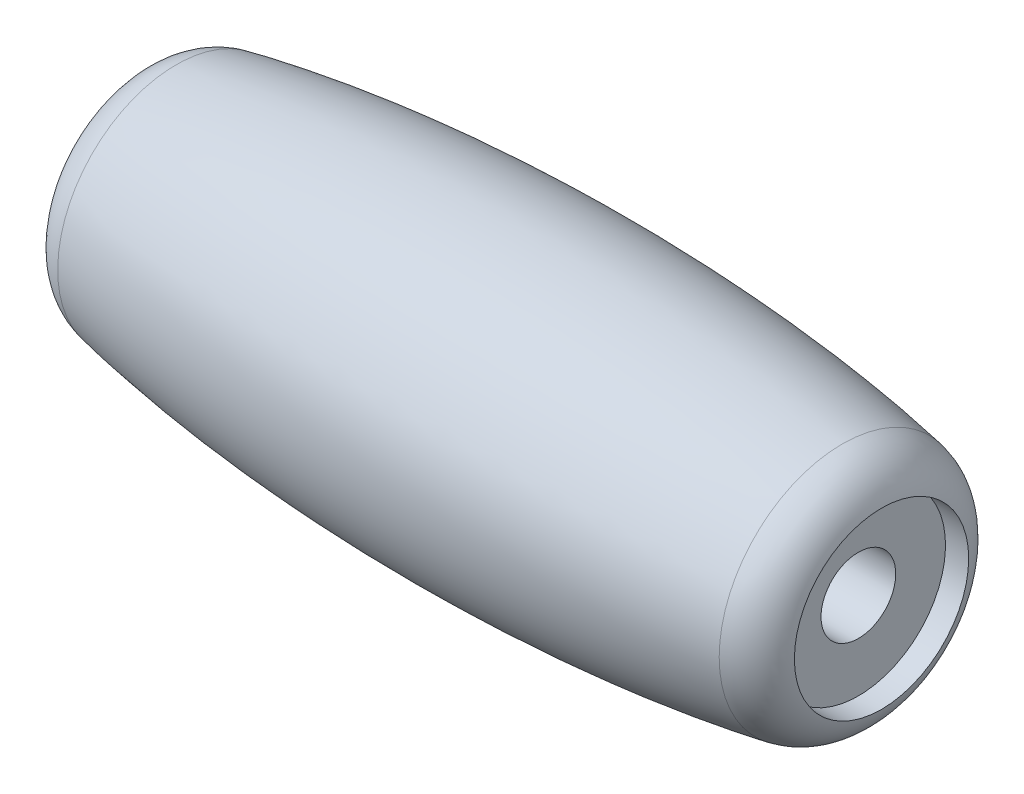
ISO-10303-21;
HEADER;
FILE_DESCRIPTION(('STEP AP214'),'2;1');
FILE_NAME('part.step','',(''),(''),'','','');
FILE_SCHEMA(('AUTOMOTIVE_DESIGN { 1 0 10303 214 1 1 1 1 }'));
ENDSEC;
DATA;
#1=APPLICATION_CONTEXT('core data for automotive mechanical design processes');
#2=APPLICATION_PROTOCOL_DEFINITION('international standard','automotive_design',2000,#1);
#3=PRODUCT_CONTEXT('',#1,'mechanical');
#4=PRODUCT('Part','Part','',(#3));
#5=PRODUCT_RELATED_PRODUCT_CATEGORY('part','',(#4));
#6=PRODUCT_DEFINITION_FORMATION('','',#4);
#7=PRODUCT_DEFINITION_CONTEXT('part definition',#1,'design');
#8=PRODUCT_DEFINITION('design','',#6,#7);
#9=PRODUCT_DEFINITION_SHAPE('','',#8);
#10=(LENGTH_UNIT() NAMED_UNIT(*) SI_UNIT(.MILLI.,.METRE.));
#11=(NAMED_UNIT(*) PLANE_ANGLE_UNIT() SI_UNIT($,.RADIAN.));
#12=(NAMED_UNIT(*) SI_UNIT($,.STERADIAN.) SOLID_ANGLE_UNIT());
#13=UNCERTAINTY_MEASURE_WITH_UNIT(LENGTH_MEASURE(1.E-05),#10,'distance_accuracy_value','');
#14=(GEOMETRIC_REPRESENTATION_CONTEXT(3) GLOBAL_UNCERTAINTY_ASSIGNED_CONTEXT((#13)) GLOBAL_UNIT_ASSIGNED_CONTEXT((#10,
#11,#12)) REPRESENTATION_CONTEXT('',''));
#15=CARTESIAN_POINT('',(0.,0.,0.));
#16=DIRECTION('',(0.,0.,1.));
#17=DIRECTION('',(1.,0.,0.));
#18=AXIS2_PLACEMENT_3D('',#15,#16,#17);
#19=CARTESIAN_POINT('',(-15.4738700674317,0.,0.));
#20=DIRECTION('',(1.,0.,0.));
#21=DIRECTION('',(0.,1.,0.));
#22=AXIS2_PLACEMENT_3D('',#19,#20,#21);
#23=CYLINDRICAL_SURFACE('',#22,1.5);
#24=CARTESIAN_POINT('',(13.5261299325683,0.,0.));
#25=DIRECTION('',(1.,0.,0.));
#26=DIRECTION('',(0.,1.,0.));
#27=AXIS2_PLACEMENT_3D('',#24,#25,#26);
#28=CIRCLE('',#27,1.5);
#29=CARTESIAN_POINT('',(13.5261299325683,1.5,0.));
#30=VERTEX_POINT('',#29);
#31=EDGE_CURVE('E55',#30,#30,#28,.T.);
#32=ORIENTED_EDGE('',*,*,#31,.T.);
#33=EDGE_LOOP('',(#32));
#34=FACE_BOUND('',#33,.T.);
#35=CARTESIAN_POINT('',(-14.4738700674317,0.,0.));
#36=DIRECTION('',(1.,0.,0.));
#37=DIRECTION('',(0.,1.,0.));
#38=AXIS2_PLACEMENT_3D('',#35,#36,#37);
#39=CIRCLE('',#38,1.5);
#40=CARTESIAN_POINT('',(-14.4738700674317,1.5,0.));
#41=VERTEX_POINT('',#40);
#42=EDGE_CURVE('E97',#41,#41,#39,.T.);
#43=ORIENTED_EDGE('',*,*,#42,.F.);
#44=EDGE_LOOP('',(#43));
#45=FACE_BOUND('',#44,.T.);
#46=ADVANCED_FACE('F34',(#34,#45),#23,.F.);
#47=CARTESIAN_POINT('',(-13.4738700674317,0.,0.));
#48=DIRECTION('',(-1.,0.,0.));
#49=DIRECTION('',(0.,-1.,0.));
#50=AXIS2_PLACEMENT_3D('',#47,#48,#49);
#51=TOROIDAL_SURFACE('',#50,2.79631353554721,1.99999999999999);
#52=CARTESIAN_POINT('',(-13.8712648360543,0.,0.));
#53=DIRECTION('',(-1.,0.,0.));
#54=DIRECTION('',(0.,-1.,0.));
#55=AXIS2_PLACEMENT_3D('',#52,#53,#54);
#56=CIRCLE('',#55,4.75643531693514);
#57=CARTESIAN_POINT('',(-13.8712648360543,-4.75643531693514,0.));
#58=VERTEX_POINT('',#57);
#59=EDGE_CURVE('E42',#58,#58,#56,.T.);
#60=ORIENTED_EDGE('',*,*,#59,.T.);
#61=EDGE_LOOP('',(#60));
#62=FACE_BOUND('',#61,.T.);
#63=CARTESIAN_POINT('',(-15.3459879482677,0.,0.));
#64=DIRECTION('',(1.,0.,0.));
#65=DIRECTION('',(0.,1.,0.));
#66=AXIS2_PLACEMENT_3D('',#63,#64,#65);
#67=CIRCLE('',#66,3.5);
#68=CARTESIAN_POINT('',(-15.3459879482677,3.5,0.));
#69=VERTEX_POINT('',#68);
#70=EDGE_CURVE('E38',#69,#69,#67,.F.);
#71=ORIENTED_EDGE('',*,*,#70,.F.);
#72=EDGE_LOOP('',(#71));
#73=FACE_BOUND('',#72,.T.);
#74=ADVANCED_FACE('F68',(#62,#73),#51,.T.);
#75=CARTESIAN_POINT('',(12.5261299325683,0.,0.));
#76=DIRECTION('',(-1.,0.,0.));
#77=DIRECTION('',(0.,-1.,0.));
#78=AXIS2_PLACEMENT_3D('',#75,#76,#77);
#79=TOROIDAL_SURFACE('',#78,2.97798218095922,2.);
#80=CARTESIAN_POINT('',(14.4568027159793,0.,0.));
#81=DIRECTION('',(-1.,0.,0.));
#82=DIRECTION('',(0.,-1.,0.));
#83=AXIS2_PLACEMENT_3D('',#80,#81,#82);
#84=CIRCLE('',#83,3.5);
#85=CARTESIAN_POINT('',(14.4568027159793,-3.5,0.));
#86=VERTEX_POINT('',#85);
#87=EDGE_CURVE('E47',#86,#86,#84,.T.);
#88=ORIENTED_EDGE('',*,*,#87,.T.);
#89=EDGE_LOOP('',(#88));
#90=FACE_BOUND('',#89,.T.);
#91=CARTESIAN_POINT('',(12.8824795736655,0.,0.));
#92=DIRECTION('',(-1.,0.,0.));
#93=DIRECTION('',(0.,-1.,0.));
#94=AXIS2_PLACEMENT_3D('',#91,#92,#93);
#95=CIRCLE('',#94,4.94597987742379);
#96=CARTESIAN_POINT('',(12.8824795736655,-4.94597987742379,0.));
#97=VERTEX_POINT('',#96);
#98=EDGE_CURVE('E10',#97,#97,#95,.T.);
#99=ORIENTED_EDGE('',*,*,#98,.F.);
#100=EDGE_LOOP('',(#99));
#101=FACE_BOUND('',#100,.T.);
#102=ADVANCED_FACE('F36',(#90,#101),#79,.T.);
#103=CARTESIAN_POINT('',(0.,0.,0.));
#104=DIRECTION('',(0.,0.,1.));
#105=DIRECTION('',(1.,0.,0.));
#106=AXIS2_PLACEMENT_3D('',#103,#104,#105);
#107=ELLIPSE('',#106,22.7561579272588,6.);
#108=TRIMMED_CURVE('',#107,(PARAMETER_VALUE(0.)),(PARAMETER_VALUE(3.14159265358979)),.T.,.PARAMETER.);
#109=CARTESIAN_POINT('',(-15.4738700674317,0.,0.));
#110=DIRECTION('',(-1.,0.,0.));
#111=AXIS1_PLACEMENT('',#109,#110);
#112=SURFACE_OF_REVOLUTION('',#108,#111);
#113=ORIENTED_EDGE('',*,*,#59,.F.);
#114=EDGE_LOOP('',(#113));
#115=FACE_BOUND('',#114,.T.);
#116=ORIENTED_EDGE('',*,*,#98,.T.);
#117=EDGE_LOOP('',(#116));
#118=FACE_BOUND('',#117,.T.);
#119=ADVANCED_FACE('F63',(#115,#118),#112,.T.);
#120=CARTESIAN_POINT('',(13.5261299325683,0.,0.));
#121=DIRECTION('',(1.,0.,0.));
#122=DIRECTION('',(0.,1.,0.));
#123=AXIS2_PLACEMENT_3D('',#120,#121,#122);
#124=CYLINDRICAL_SURFACE('',#123,3.5);
#125=CARTESIAN_POINT('',(13.5261299325683,0.,0.));
#126=DIRECTION('',(1.,0.,0.));
#127=DIRECTION('',(0.,1.,0.));
#128=AXIS2_PLACEMENT_3D('',#125,#126,#127);
#129=CIRCLE('',#128,3.5);
#130=CARTESIAN_POINT('',(13.5261299325683,3.5,0.));
#131=VERTEX_POINT('',#130);
#132=EDGE_CURVE('E51',#131,#131,#129,.T.);
#133=ORIENTED_EDGE('',*,*,#132,.F.);
#134=EDGE_LOOP('',(#133));
#135=FACE_BOUND('',#134,.T.);
#136=ORIENTED_EDGE('',*,*,#87,.F.);
#137=EDGE_LOOP('',(#136));
#138=FACE_BOUND('',#137,.T.);
#139=ADVANCED_FACE('F66',(#135,#138),#124,.F.);
#140=CARTESIAN_POINT('',(13.5261299325683,0.,0.));
#141=DIRECTION('',(1.,0.,0.));
#142=DIRECTION('',(0.,1.,0.));
#143=AXIS2_PLACEMENT_3D('',#140,#141,#142);
#144=PLANE('',#143);
#145=ORIENTED_EDGE('',*,*,#31,.F.);
#146=EDGE_LOOP('',(#145));
#147=FACE_BOUND('',#146,.T.);
#148=ORIENTED_EDGE('',*,*,#132,.T.);
#149=EDGE_LOOP('',(#148));
#150=FACE_BOUND('',#149,.T.);
#151=ADVANCED_FACE('F77',(#147,#150),#144,.T.);
#152=CARTESIAN_POINT('',(-14.4738700674317,0.,0.));
#153=DIRECTION('',(-1.,0.,0.));
#154=DIRECTION('',(0.,-1.,0.));
#155=AXIS2_PLACEMENT_3D('',#152,#153,#154);
#156=CYLINDRICAL_SURFACE('',#155,3.5);
#157=CARTESIAN_POINT('',(-14.4738700674317,0.,0.));
#158=DIRECTION('',(1.,0.,0.));
#159=DIRECTION('',(0.,1.,0.));
#160=AXIS2_PLACEMENT_3D('',#157,#158,#159);
#161=CIRCLE('',#160,3.5);
#162=CARTESIAN_POINT('',(-14.4738700674317,3.5,0.));
#163=VERTEX_POINT('',#162);
#164=EDGE_CURVE('E94',#163,#163,#161,.T.);
#165=ORIENTED_EDGE('',*,*,#164,.T.);
#166=EDGE_LOOP('',(#165));
#167=FACE_BOUND('',#166,.T.);
#168=ORIENTED_EDGE('',*,*,#70,.T.);
#169=EDGE_LOOP('',(#168));
#170=FACE_BOUND('',#169,.T.);
#171=ADVANCED_FACE('F81',(#167,#170),#156,.F.);
#172=CARTESIAN_POINT('',(-14.4738700674317,0.,0.));
#173=DIRECTION('',(-1.,0.,0.));
#174=DIRECTION('',(0.,1.,0.));
#175=AXIS2_PLACEMENT_3D('',#172,#173,#174);
#176=PLANE('',#175);
#177=ORIENTED_EDGE('',*,*,#164,.F.);
#178=EDGE_LOOP('',(#177));
#179=FACE_BOUND('',#178,.T.);
#180=ORIENTED_EDGE('',*,*,#42,.T.);
#181=EDGE_LOOP('',(#180));
#182=FACE_BOUND('',#181,.T.);
#183=ADVANCED_FACE('F85',(#179,#182),#176,.T.);
#184=CLOSED_SHELL('',(#46,#74,#102,#119,#139,#151,#171,#183));
#185=MANIFOLD_SOLID_BREP('B2',#184);
#186=ADVANCED_BREP_SHAPE_REPRESENTATION('',(#18,#185),#14);
#187=SHAPE_DEFINITION_REPRESENTATION(#9,#186);
ENDSEC;
END-ISO-10303-21;
